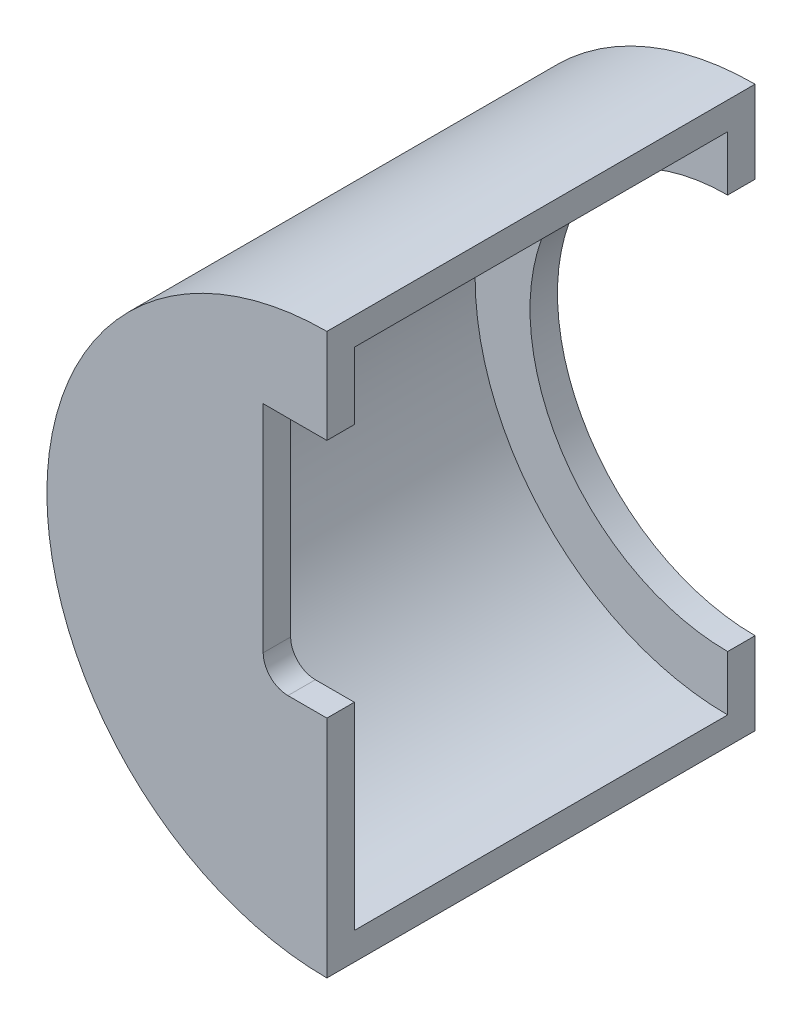
ISO-10303-21;
HEADER;
FILE_DESCRIPTION(('STEP AP214'),'2;1');
FILE_NAME('part.step','',(''),(''),'','','');
FILE_SCHEMA(('AUTOMOTIVE_DESIGN { 1 0 10303 214 1 1 1 1 }'));
ENDSEC;
DATA;
#1=APPLICATION_CONTEXT('core data for automotive mechanical design processes');
#2=APPLICATION_PROTOCOL_DEFINITION('international standard','automotive_design',2000,#1);
#3=PRODUCT_CONTEXT('',#1,'mechanical');
#4=PRODUCT('Part','Part','',(#3));
#5=PRODUCT_RELATED_PRODUCT_CATEGORY('part','',(#4));
#6=PRODUCT_DEFINITION_FORMATION('','',#4);
#7=PRODUCT_DEFINITION_CONTEXT('part definition',#1,'design');
#8=PRODUCT_DEFINITION('design','',#6,#7);
#9=PRODUCT_DEFINITION_SHAPE('','',#8);
#10=(LENGTH_UNIT() NAMED_UNIT(*) SI_UNIT(.MILLI.,.METRE.));
#11=(NAMED_UNIT(*) PLANE_ANGLE_UNIT() SI_UNIT($,.RADIAN.));
#12=(NAMED_UNIT(*) SI_UNIT($,.STERADIAN.) SOLID_ANGLE_UNIT());
#13=UNCERTAINTY_MEASURE_WITH_UNIT(LENGTH_MEASURE(1.E-05),#10,'distance_accuracy_value','');
#14=(GEOMETRIC_REPRESENTATION_CONTEXT(3) GLOBAL_UNCERTAINTY_ASSIGNED_CONTEXT((#13)) GLOBAL_UNIT_ASSIGNED_CONTEXT((#10,
#11,#12)) REPRESENTATION_CONTEXT('',''));
#15=CARTESIAN_POINT('',(0.,0.,0.));
#16=DIRECTION('',(0.,0.,1.));
#17=DIRECTION('',(1.,0.,0.));
#18=AXIS2_PLACEMENT_3D('',#15,#16,#17);
#19=CARTESIAN_POINT('',(0.,-46.,34.));
#20=DIRECTION('',(-1.,0.,0.));
#21=DIRECTION('',(0.,-1.,0.));
#22=AXIS2_PLACEMENT_3D('',#19,#20,#21);
#23=PLANE('',#22);
#24=DIRECTION('',(0.,0.,1.));
#25=VECTOR('',#24,1.);
#26=CARTESIAN_POINT('',(0.,33.8,29.));
#27=LINE('',#26,#25);
#28=CARTESIAN_POINT('',(0.,33.8,34.));
#29=VERTEX_POINT('',#28);
#30=CARTESIAN_POINT('',(0.,33.8,39.));
#31=VERTEX_POINT('',#30);
#32=EDGE_CURVE('E87',#29,#31,#27,.T.);
#33=ORIENTED_EDGE('',*,*,#32,.F.);
#34=DIRECTION('',(0.,1.,0.));
#35=VECTOR('',#34,1.);
#36=CARTESIAN_POINT('',(0.,51.,34.));
#37=LINE('',#36,#35);
#38=CARTESIAN_POINT('',(0.,46.,34.));
#39=VERTEX_POINT('',#38);
#40=EDGE_CURVE('E73',#29,#39,#37,.T.);
#41=ORIENTED_EDGE('',*,*,#40,.T.);
#42=DIRECTION('',(0.,0.,-1.));
#43=VECTOR('',#42,1.);
#44=CARTESIAN_POINT('',(0.,46.,34.));
#45=LINE('',#44,#43);
#46=CARTESIAN_POINT('',(0.,46.,-34.));
#47=VERTEX_POINT('',#46);
#48=EDGE_CURVE('E12',#39,#47,#45,.T.);
#49=ORIENTED_EDGE('',*,*,#48,.T.);
#50=DIRECTION('',(0.,-1.,0.));
#51=VECTOR('',#50,1.);
#52=CARTESIAN_POINT('',(0.,51.,-34.));
#53=LINE('',#52,#51);
#54=CARTESIAN_POINT('',(0.,36.,-34.));
#55=VERTEX_POINT('',#54);
#56=EDGE_CURVE('E200',#47,#55,#53,.T.);
#57=ORIENTED_EDGE('',*,*,#56,.T.);
#58=DIRECTION('',(0.,0.,1.));
#59=VECTOR('',#58,1.);
#60=CARTESIAN_POINT('',(0.,36.,-39.));
#61=LINE('',#60,#59);
#62=CARTESIAN_POINT('',(0.,36.,-39.));
#63=VERTEX_POINT('',#62);
#64=EDGE_CURVE('E261',#63,#55,#61,.T.);
#65=ORIENTED_EDGE('',*,*,#64,.F.);
#66=DIRECTION('',(0.,-1.,0.));
#67=VECTOR('',#66,1.);
#68=CARTESIAN_POINT('',(0.,51.,-39.));
#69=LINE('',#68,#67);
#70=CARTESIAN_POINT('',(0.,51.,-39.));
#71=VERTEX_POINT('',#70);
#72=EDGE_CURVE('E204',#71,#63,#69,.T.);
#73=ORIENTED_EDGE('',*,*,#72,.F.);
#74=DIRECTION('',(0.,0.,-1.));
#75=VECTOR('',#74,1.);
#76=CARTESIAN_POINT('',(0.,51.,34.));
#77=LINE('',#76,#75);
#78=CARTESIAN_POINT('',(0.,51.,39.));
#79=VERTEX_POINT('',#78);
#80=EDGE_CURVE('E79',#79,#71,#77,.T.);
#81=ORIENTED_EDGE('',*,*,#80,.F.);
#82=DIRECTION('',(0.,1.,0.));
#83=VECTOR('',#82,1.);
#84=CARTESIAN_POINT('',(0.,51.,39.));
#85=LINE('',#84,#83);
#86=EDGE_CURVE('E224',#31,#79,#85,.T.);
#87=ORIENTED_EDGE('',*,*,#86,.F.);
#88=EDGE_LOOP('',(#33,#41,#49,#57,#65,#73,#81,#87));
#89=FACE_BOUND('',#88,.T.);
#90=ADVANCED_FACE('F69',(#89),#23,.F.);
#91=CARTESIAN_POINT('',(0.,-46.,34.));
#92=VERTEX_POINT('',#91);
#93=CARTESIAN_POINT('',(0.,-10.000000044355,34.));
#94=VERTEX_POINT('',#93);
#95=EDGE_CURVE('E225',#92,#94,#37,.T.);
#96=ORIENTED_EDGE('',*,*,#95,.T.);
#97=DIRECTION('',(0.,0.,1.));
#98=VECTOR('',#97,1.);
#99=CARTESIAN_POINT('',(0.,-10.000000044355,29.));
#100=LINE('',#99,#98);
#101=CARTESIAN_POINT('',(0.,-10.000000044355,39.));
#102=VERTEX_POINT('',#101);
#103=EDGE_CURVE('E189',#94,#102,#100,.T.);
#104=ORIENTED_EDGE('',*,*,#103,.T.);
#105=CARTESIAN_POINT('',(0.,-51.,39.));
#106=VERTEX_POINT('',#105);
#107=EDGE_CURVE('E226',#106,#102,#85,.T.);
#108=ORIENTED_EDGE('',*,*,#107,.F.);
#109=DIRECTION('',(0.,0.,-1.));
#110=VECTOR('',#109,1.);
#111=CARTESIAN_POINT('',(0.,-51.,34.));
#112=LINE('',#111,#110);
#113=CARTESIAN_POINT('',(0.,-51.,-39.));
#114=VERTEX_POINT('',#113);
#115=EDGE_CURVE('E243',#106,#114,#112,.T.);
#116=ORIENTED_EDGE('',*,*,#115,.T.);
#117=DIRECTION('',(0.,-1.,0.));
#118=VECTOR('',#117,1.);
#119=CARTESIAN_POINT('',(0.,-51.,-39.));
#120=LINE('',#119,#118);
#121=CARTESIAN_POINT('',(0.,-36.,-39.));
#122=VERTEX_POINT('',#121);
#123=EDGE_CURVE('E209',#122,#114,#120,.T.);
#124=ORIENTED_EDGE('',*,*,#123,.F.);
#125=DIRECTION('',(0.,0.,1.));
#126=VECTOR('',#125,1.);
#127=CARTESIAN_POINT('',(0.,-36.,-39.));
#128=LINE('',#127,#126);
#129=CARTESIAN_POINT('',(0.,-36.,-34.));
#130=VERTEX_POINT('',#129);
#131=EDGE_CURVE('E212',#122,#130,#128,.T.);
#132=ORIENTED_EDGE('',*,*,#131,.T.);
#133=DIRECTION('',(0.,-1.,0.));
#134=VECTOR('',#133,1.);
#135=CARTESIAN_POINT('',(0.,-51.,-34.));
#136=LINE('',#135,#134);
#137=CARTESIAN_POINT('',(0.,-46.,-34.));
#138=VERTEX_POINT('',#137);
#139=EDGE_CURVE('E205',#130,#138,#136,.T.);
#140=ORIENTED_EDGE('',*,*,#139,.T.);
#141=DIRECTION('',(0.,0.,-1.));
#142=VECTOR('',#141,1.);
#143=CARTESIAN_POINT('',(0.,-46.,34.));
#144=LINE('',#143,#142);
#145=EDGE_CURVE('E96',#92,#138,#144,.T.);
#146=ORIENTED_EDGE('',*,*,#145,.F.);
#147=EDGE_LOOP('',(#96,#104,#108,#116,#124,#132,#140,#146));
#148=FACE_BOUND('',#147,.T.);
#149=ADVANCED_FACE('F253',(#148),#23,.F.);
#150=CARTESIAN_POINT('',(0.,0.,34.));
#151=DIRECTION('',(0.,0.,-1.));
#152=DIRECTION('',(-1.,0.,0.));
#153=AXIS2_PLACEMENT_3D('',#150,#151,#152);
#154=CYLINDRICAL_SURFACE('',#153,46.);
#155=CARTESIAN_POINT('',(0.,0.,-34.));
#156=DIRECTION('',(0.,0.,-1.));
#157=DIRECTION('',(1.,0.,0.));
#158=AXIS2_PLACEMENT_3D('',#155,#156,#157);
#159=CIRCLE('',#158,46.);
#160=EDGE_CURVE('E227',#138,#47,#159,.T.);
#161=ORIENTED_EDGE('',*,*,#160,.T.);
#162=ORIENTED_EDGE('',*,*,#48,.F.);
#163=CARTESIAN_POINT('',(0.,0.,34.));
#164=DIRECTION('',(0.,0.,-1.));
#165=DIRECTION('',(1.,0.,0.));
#166=AXIS2_PLACEMENT_3D('',#163,#164,#165);
#167=CIRCLE('',#166,46.);
#168=EDGE_CURVE('E237',#92,#39,#167,.T.);
#169=ORIENTED_EDGE('',*,*,#168,.F.);
#170=ORIENTED_EDGE('',*,*,#145,.T.);
#171=EDGE_LOOP('',(#161,#162,#169,#170));
#172=FACE_BOUND('',#171,.T.);
#173=ADVANCED_FACE('F71',(#172),#154,.F.);
#174=CARTESIAN_POINT('',(0.,0.,34.));
#175=DIRECTION('',(0.,0.,-1.));
#176=DIRECTION('',(-1.,0.,0.));
#177=AXIS2_PLACEMENT_3D('',#174,#175,#176);
#178=CYLINDRICAL_SURFACE('',#177,51.);
#179=ORIENTED_EDGE('',*,*,#80,.T.);
#180=CARTESIAN_POINT('',(0.,0.,-39.));
#181=DIRECTION('',(0.,0.,-1.));
#182=DIRECTION('',(-1.,0.,0.));
#183=AXIS2_PLACEMENT_3D('',#180,#181,#182);
#184=CIRCLE('',#183,51.);
#185=EDGE_CURVE('E201',#114,#71,#184,.T.);
#186=ORIENTED_EDGE('',*,*,#185,.F.);
#187=ORIENTED_EDGE('',*,*,#115,.F.);
#188=CARTESIAN_POINT('',(0.,0.,39.));
#189=DIRECTION('',(0.,0.,1.));
#190=DIRECTION('',(1.,0.,0.));
#191=AXIS2_PLACEMENT_3D('',#188,#189,#190);
#192=CIRCLE('',#191,51.);
#193=EDGE_CURVE('E221',#79,#106,#192,.T.);
#194=ORIENTED_EDGE('',*,*,#193,.F.);
#195=EDGE_LOOP('',(#179,#186,#187,#194));
#196=FACE_BOUND('',#195,.T.);
#197=ADVANCED_FACE('F277',(#196),#178,.T.);
#198=CARTESIAN_POINT('',(0.,0.,34.));
#199=DIRECTION('',(0.,0.,1.));
#200=DIRECTION('',(1.,0.,0.));
#201=AXIS2_PLACEMENT_3D('',#198,#199,#200);
#202=PLANE('',#201);
#203=CARTESIAN_POINT('',(-7.09999987129,-5.499999955645,34.));
#204=DIRECTION('',(0.,0.,1.));
#205=DIRECTION('',(1.,0.,0.));
#206=AXIS2_PLACEMENT_3D('',#203,#204,#205);
#207=CIRCLE('',#206,4.50000008871);
#208=CARTESIAN_POINT('',(-11.59999996,-5.499999955645,34.));
#209=VERTEX_POINT('',#208);
#210=CARTESIAN_POINT('',(-7.09999987129,-10.000000044355,34.));
#211=VERTEX_POINT('',#210);
#212=EDGE_CURVE('E166',#209,#211,#207,.T.);
#213=ORIENTED_EDGE('',*,*,#212,.T.);
#214=DIRECTION('',(1.,0.,0.));
#215=VECTOR('',#214,1.);
#216=CARTESIAN_POINT('',(0.,-10.000000044355,34.));
#217=LINE('',#216,#215);
#218=EDGE_CURVE('E197',#211,#94,#217,.T.);
#219=ORIENTED_EDGE('',*,*,#218,.T.);
#220=ORIENTED_EDGE('',*,*,#95,.F.);
#221=ORIENTED_EDGE('',*,*,#168,.T.);
#222=ORIENTED_EDGE('',*,*,#40,.F.);
#223=DIRECTION('',(1.,0.,0.));
#224=VECTOR('',#223,1.);
#225=CARTESIAN_POINT('',(0.,33.8,34.));
#226=LINE('',#225,#224);
#227=CARTESIAN_POINT('',(-11.59999996,33.8,34.));
#228=VERTEX_POINT('',#227);
#229=EDGE_CURVE('E187',#228,#29,#226,.T.);
#230=ORIENTED_EDGE('',*,*,#229,.F.);
#231=DIRECTION('',(0.,1.,0.));
#232=VECTOR('',#231,1.);
#233=CARTESIAN_POINT('',(-11.59999996,0.,34.));
#234=LINE('',#233,#232);
#235=EDGE_CURVE('E194',#209,#228,#234,.T.);
#236=ORIENTED_EDGE('',*,*,#235,.F.);
#237=EDGE_LOOP('',(#213,#219,#220,#221,#222,#230,#236));
#238=FACE_BOUND('',#237,.T.);
#239=ADVANCED_FACE('F270',(#238),#202,.F.);
#240=CARTESIAN_POINT('',(0.,0.,39.));
#241=DIRECTION('',(0.,0.,1.));
#242=DIRECTION('',(1.,0.,0.));
#243=AXIS2_PLACEMENT_3D('',#240,#241,#242);
#244=PLANE('',#243);
#245=DIRECTION('',(1.,0.,0.));
#246=VECTOR('',#245,1.);
#247=CARTESIAN_POINT('',(0.,-10.000000044355,39.));
#248=LINE('',#247,#246);
#249=CARTESIAN_POINT('',(-7.09999987129,-10.000000044355,39.));
#250=VERTEX_POINT('',#249);
#251=EDGE_CURVE('E181',#250,#102,#248,.T.);
#252=ORIENTED_EDGE('',*,*,#251,.F.);
#253=CARTESIAN_POINT('',(-7.09999987129,-5.499999955645,39.));
#254=DIRECTION('',(0.,0.,1.));
#255=DIRECTION('',(1.,0.,0.));
#256=AXIS2_PLACEMENT_3D('',#253,#254,#255);
#257=CIRCLE('',#256,4.50000008871);
#258=CARTESIAN_POINT('',(-11.59999996,-5.499999955645,39.));
#259=VERTEX_POINT('',#258);
#260=EDGE_CURVE('E163',#259,#250,#257,.T.);
#261=ORIENTED_EDGE('',*,*,#260,.F.);
#262=DIRECTION('',(0.,1.,0.));
#263=VECTOR('',#262,1.);
#264=CARTESIAN_POINT('',(-11.59999996,0.,39.));
#265=LINE('',#264,#263);
#266=CARTESIAN_POINT('',(-11.59999996,33.8,39.));
#267=VERTEX_POINT('',#266);
#268=EDGE_CURVE('E173',#259,#267,#265,.T.);
#269=ORIENTED_EDGE('',*,*,#268,.T.);
#270=DIRECTION('',(1.,0.,0.));
#271=VECTOR('',#270,1.);
#272=CARTESIAN_POINT('',(0.,33.8,39.));
#273=LINE('',#272,#271);
#274=EDGE_CURVE('E170',#267,#31,#273,.T.);
#275=ORIENTED_EDGE('',*,*,#274,.T.);
#276=ORIENTED_EDGE('',*,*,#86,.T.);
#277=ORIENTED_EDGE('',*,*,#193,.T.);
#278=ORIENTED_EDGE('',*,*,#107,.T.);
#279=EDGE_LOOP('',(#252,#261,#269,#275,#276,#277,#278));
#280=FACE_BOUND('',#279,.T.);
#281=ADVANCED_FACE('F179',(#280),#244,.T.);
#282=CARTESIAN_POINT('',(0.,0.,-39.));
#283=DIRECTION('',(0.,0.,1.));
#284=DIRECTION('',(1.,0.,0.));
#285=AXIS2_PLACEMENT_3D('',#282,#283,#284);
#286=CYLINDRICAL_SURFACE('',#285,36.);
#287=CARTESIAN_POINT('',(0.,0.,-34.));
#288=DIRECTION('',(0.,0.,1.));
#289=DIRECTION('',(-1.,0.,0.));
#290=AXIS2_PLACEMENT_3D('',#287,#288,#289);
#291=CIRCLE('',#290,36.);
#292=EDGE_CURVE('E215',#55,#130,#291,.T.);
#293=ORIENTED_EDGE('',*,*,#292,.T.);
#294=ORIENTED_EDGE('',*,*,#131,.F.);
#295=CARTESIAN_POINT('',(0.,0.,-39.));
#296=DIRECTION('',(0.,0.,1.));
#297=DIRECTION('',(-1.,0.,0.));
#298=AXIS2_PLACEMENT_3D('',#295,#296,#297);
#299=CIRCLE('',#298,36.);
#300=EDGE_CURVE('E207',#63,#122,#299,.T.);
#301=ORIENTED_EDGE('',*,*,#300,.F.);
#302=ORIENTED_EDGE('',*,*,#64,.T.);
#303=EDGE_LOOP('',(#293,#294,#301,#302));
#304=FACE_BOUND('',#303,.T.);
#305=ADVANCED_FACE('F258',(#304),#286,.F.);
#306=CARTESIAN_POINT('',(0.,0.,-39.));
#307=DIRECTION('',(0.,0.,-1.));
#308=DIRECTION('',(-1.,0.,0.));
#309=AXIS2_PLACEMENT_3D('',#306,#307,#308);
#310=PLANE('',#309);
#311=ORIENTED_EDGE('',*,*,#185,.T.);
#312=ORIENTED_EDGE('',*,*,#72,.T.);
#313=ORIENTED_EDGE('',*,*,#300,.T.);
#314=ORIENTED_EDGE('',*,*,#123,.T.);
#315=EDGE_LOOP('',(#311,#312,#313,#314));
#316=FACE_BOUND('',#315,.T.);
#317=ADVANCED_FACE('F281',(#316),#310,.T.);
#318=CARTESIAN_POINT('',(0.,0.,-34.));
#319=DIRECTION('',(0.,0.,-1.));
#320=DIRECTION('',(-1.,0.,0.));
#321=AXIS2_PLACEMENT_3D('',#318,#319,#320);
#322=PLANE('',#321);
#323=ORIENTED_EDGE('',*,*,#160,.F.);
#324=ORIENTED_EDGE('',*,*,#139,.F.);
#325=ORIENTED_EDGE('',*,*,#292,.F.);
#326=ORIENTED_EDGE('',*,*,#56,.F.);
#327=EDGE_LOOP('',(#323,#324,#325,#326));
#328=FACE_BOUND('',#327,.T.);
#329=ADVANCED_FACE('F250',(#328),#322,.F.);
#330=CARTESIAN_POINT('',(0.,-10.000000044355,29.));
#331=DIRECTION('',(0.,-1.,0.));
#332=DIRECTION('',(0.,0.,-1.));
#333=AXIS2_PLACEMENT_3D('',#330,#331,#332);
#334=PLANE('',#333);
#335=DIRECTION('',(0.,0.,1.));
#336=VECTOR('',#335,1.);
#337=CARTESIAN_POINT('',(-7.09999987129,-10.000000044355,29.));
#338=LINE('',#337,#336);
#339=EDGE_CURVE('E169',#211,#250,#338,.T.);
#340=ORIENTED_EDGE('',*,*,#339,.T.);
#341=ORIENTED_EDGE('',*,*,#251,.T.);
#342=ORIENTED_EDGE('',*,*,#103,.F.);
#343=ORIENTED_EDGE('',*,*,#218,.F.);
#344=EDGE_LOOP('',(#340,#341,#342,#343));
#345=FACE_BOUND('',#344,.T.);
#346=ADVANCED_FACE('F288',(#345),#334,.F.);
#347=CARTESIAN_POINT('',(-7.09999987129,-5.499999955645,29.));
#348=DIRECTION('',(0.,0.,1.));
#349=DIRECTION('',(1.,0.,0.));
#350=AXIS2_PLACEMENT_3D('',#347,#348,#349);
#351=CYLINDRICAL_SURFACE('',#350,4.50000008871);
#352=DIRECTION('',(0.,0.,1.));
#353=VECTOR('',#352,1.);
#354=CARTESIAN_POINT('',(-11.59999996,-5.499999955645,29.));
#355=LINE('',#354,#353);
#356=EDGE_CURVE('E158',#209,#259,#355,.T.);
#357=ORIENTED_EDGE('',*,*,#356,.T.);
#358=ORIENTED_EDGE('',*,*,#260,.T.);
#359=ORIENTED_EDGE('',*,*,#339,.F.);
#360=ORIENTED_EDGE('',*,*,#212,.F.);
#361=EDGE_LOOP('',(#357,#358,#359,#360));
#362=FACE_BOUND('',#361,.T.);
#363=ADVANCED_FACE('F160',(#362),#351,.F.);
#364=CARTESIAN_POINT('',(-11.59999996,0.,29.));
#365=DIRECTION('',(1.,0.,0.));
#366=DIRECTION('',(0.,1.,0.));
#367=AXIS2_PLACEMENT_3D('',#364,#365,#366);
#368=PLANE('',#367);
#369=ORIENTED_EDGE('',*,*,#235,.T.);
#370=DIRECTION('',(0.,0.,1.));
#371=VECTOR('',#370,1.);
#372=CARTESIAN_POINT('',(-11.59999996,33.8,29.));
#373=LINE('',#372,#371);
#374=EDGE_CURVE('E176',#228,#267,#373,.T.);
#375=ORIENTED_EDGE('',*,*,#374,.T.);
#376=ORIENTED_EDGE('',*,*,#268,.F.);
#377=ORIENTED_EDGE('',*,*,#356,.F.);
#378=EDGE_LOOP('',(#369,#375,#376,#377));
#379=FACE_BOUND('',#378,.T.);
#380=ADVANCED_FACE('F174',(#379),#368,.T.);
#381=CARTESIAN_POINT('',(0.,33.8,29.));
#382=DIRECTION('',(0.,-1.,0.));
#383=DIRECTION('',(0.,0.,-1.));
#384=AXIS2_PLACEMENT_3D('',#381,#382,#383);
#385=PLANE('',#384);
#386=ORIENTED_EDGE('',*,*,#229,.T.);
#387=ORIENTED_EDGE('',*,*,#32,.T.);
#388=ORIENTED_EDGE('',*,*,#274,.F.);
#389=ORIENTED_EDGE('',*,*,#374,.F.);
#390=EDGE_LOOP('',(#386,#387,#388,#389));
#391=FACE_BOUND('',#390,.T.);
#392=ADVANCED_FACE('F356',(#391),#385,.T.);
#393=CLOSED_SHELL('',(#90,#149,#173,#197,#239,#281,#305,#317,#329,#346,#363,#380,#392));
#394=MANIFOLD_SOLID_BREP('B2',#393);
#395=ADVANCED_BREP_SHAPE_REPRESENTATION('',(#18,#394),#14);
#396=SHAPE_DEFINITION_REPRESENTATION(#9,#395);
ENDSEC;
END-ISO-10303-21;
